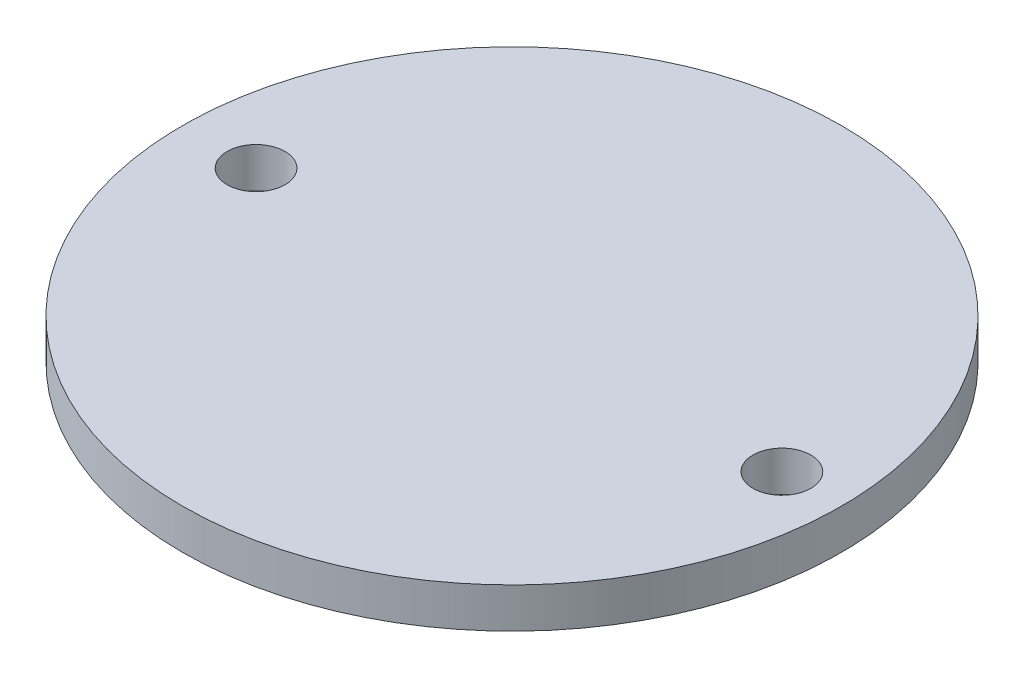
ISO-10303-21;
HEADER;
FILE_DESCRIPTION(('STEP AP214'),'2;1');
FILE_NAME('part.step','',(''),(''),'','','');
FILE_SCHEMA(('AUTOMOTIVE_DESIGN { 1 0 10303 214 1 1 1 1 }'));
ENDSEC;
DATA;
#1=APPLICATION_CONTEXT('core data for automotive mechanical design processes');
#2=APPLICATION_PROTOCOL_DEFINITION('international standard','automotive_design',2000,#1);
#3=PRODUCT_CONTEXT('',#1,'mechanical');
#4=PRODUCT('Part','Part','',(#3));
#5=PRODUCT_RELATED_PRODUCT_CATEGORY('part','',(#4));
#6=PRODUCT_DEFINITION_FORMATION('','',#4);
#7=PRODUCT_DEFINITION_CONTEXT('part definition',#1,'design');
#8=PRODUCT_DEFINITION('design','',#6,#7);
#9=PRODUCT_DEFINITION_SHAPE('','',#8);
#10=(LENGTH_UNIT() NAMED_UNIT(*) SI_UNIT(.MILLI.,.METRE.));
#11=(NAMED_UNIT(*) PLANE_ANGLE_UNIT() SI_UNIT($,.RADIAN.));
#12=(NAMED_UNIT(*) SI_UNIT($,.STERADIAN.) SOLID_ANGLE_UNIT());
#13=UNCERTAINTY_MEASURE_WITH_UNIT(LENGTH_MEASURE(1.E-05),#10,'distance_accuracy_value','');
#14=(GEOMETRIC_REPRESENTATION_CONTEXT(3) GLOBAL_UNCERTAINTY_ASSIGNED_CONTEXT((#13)) GLOBAL_UNIT_ASSIGNED_CONTEXT((#10,
#11,#12)) REPRESENTATION_CONTEXT('',''));
#15=CARTESIAN_POINT('',(0.,0.,0.));
#16=DIRECTION('',(0.,0.,1.));
#17=DIRECTION('',(1.,0.,0.));
#18=AXIS2_PLACEMENT_3D('',#15,#16,#17);
#19=CARTESIAN_POINT('',(0.,0.762,0.));
#20=DIRECTION('',(0.,-1.,0.));
#21=DIRECTION('',(0.,0.,-1.));
#22=AXIS2_PLACEMENT_3D('',#19,#20,#21);
#23=CYLINDRICAL_SURFACE('',#22,12.5349);
#24=CARTESIAN_POINT('',(0.,0.762,0.));
#25=DIRECTION('',(0.,1.,0.));
#26=DIRECTION('',(0.,0.,1.));
#27=AXIS2_PLACEMENT_3D('',#24,#25,#26);
#28=CIRCLE('',#27,12.5349);
#29=CARTESIAN_POINT('',(0.,0.762,12.5349));
#30=VERTEX_POINT('',#29);
#31=EDGE_CURVE('E10',#30,#30,#28,.T.);
#32=ORIENTED_EDGE('',*,*,#31,.F.);
#33=EDGE_LOOP('',(#32));
#34=FACE_BOUND('',#33,.T.);
#35=CARTESIAN_POINT('',(0.,-0.762,0.));
#36=DIRECTION('',(0.,1.,0.));
#37=DIRECTION('',(0.,0.,1.));
#38=AXIS2_PLACEMENT_3D('',#35,#36,#37);
#39=CIRCLE('',#38,12.5349);
#40=CARTESIAN_POINT('',(0.,-0.762,12.5349));
#41=VERTEX_POINT('',#40);
#42=EDGE_CURVE('E33',#41,#41,#39,.T.);
#43=ORIENTED_EDGE('',*,*,#42,.T.);
#44=EDGE_LOOP('',(#43));
#45=FACE_BOUND('',#44,.T.);
#46=ADVANCED_FACE('F30',(#34,#45),#23,.T.);
#47=CARTESIAN_POINT('',(0.,0.762,0.));
#48=DIRECTION('',(0.,1.,0.));
#49=DIRECTION('',(0.,0.,1.));
#50=AXIS2_PLACEMENT_3D('',#47,#48,#49);
#51=PLANE('',#50);
#52=CARTESIAN_POINT('',(10.265099988,0.762,0.));
#53=DIRECTION('',(0.,1.,0.));
#54=DIRECTION('',(0.,0.,1.));
#55=AXIS2_PLACEMENT_3D('',#52,#53,#54);
#56=CIRCLE('',#55,1.09999999999999);
#57=CARTESIAN_POINT('',(10.265099988,0.762,1.09999999999999));
#58=VERTEX_POINT('',#57);
#59=EDGE_CURVE('E48',#58,#58,#56,.T.);
#60=ORIENTED_EDGE('',*,*,#59,.F.);
#61=EDGE_LOOP('',(#60));
#62=FACE_BOUND('',#61,.T.);
#63=CARTESIAN_POINT('',(-9.734900012,0.762,0.));
#64=DIRECTION('',(0.,1.,0.));
#65=DIRECTION('',(0.,0.,1.));
#66=AXIS2_PLACEMENT_3D('',#63,#64,#65);
#67=CIRCLE('',#66,1.09999999999999);
#68=CARTESIAN_POINT('',(-9.734900012,0.762,1.09999999999999));
#69=VERTEX_POINT('',#68);
#70=EDGE_CURVE('E42',#69,#69,#67,.T.);
#71=ORIENTED_EDGE('',*,*,#70,.F.);
#72=EDGE_LOOP('',(#71));
#73=FACE_BOUND('',#72,.T.);
#74=ORIENTED_EDGE('',*,*,#31,.T.);
#75=EDGE_LOOP('',(#74));
#76=FACE_BOUND('',#75,.T.);
#77=ADVANCED_FACE('F64',(#62,#73,#76),#51,.T.);
#78=CARTESIAN_POINT('',(0.,-0.762,0.));
#79=DIRECTION('',(0.,1.,0.));
#80=DIRECTION('',(0.,0.,1.));
#81=AXIS2_PLACEMENT_3D('',#78,#79,#80);
#82=PLANE('',#81);
#83=CARTESIAN_POINT('',(10.265099988,-0.762,0.));
#84=DIRECTION('',(0.,1.,0.));
#85=DIRECTION('',(0.,0.,1.));
#86=AXIS2_PLACEMENT_3D('',#83,#84,#85);
#87=CIRCLE('',#86,1.09999999999999);
#88=CARTESIAN_POINT('',(10.265099988,-0.762,1.09999999999999));
#89=VERTEX_POINT('',#88);
#90=EDGE_CURVE('E45',#89,#89,#87,.T.);
#91=ORIENTED_EDGE('',*,*,#90,.T.);
#92=EDGE_LOOP('',(#91));
#93=FACE_BOUND('',#92,.T.);
#94=CARTESIAN_POINT('',(-9.734900012,-0.762,0.));
#95=DIRECTION('',(0.,1.,0.));
#96=DIRECTION('',(0.,0.,1.));
#97=AXIS2_PLACEMENT_3D('',#94,#95,#96);
#98=CIRCLE('',#97,1.09999999999999);
#99=CARTESIAN_POINT('',(-9.734900012,-0.762,1.09999999999999));
#100=VERTEX_POINT('',#99);
#101=EDGE_CURVE('E40',#100,#100,#98,.T.);
#102=ORIENTED_EDGE('',*,*,#101,.T.);
#103=EDGE_LOOP('',(#102));
#104=FACE_BOUND('',#103,.T.);
#105=ORIENTED_EDGE('',*,*,#42,.F.);
#106=EDGE_LOOP('',(#105));
#107=FACE_BOUND('',#106,.T.);
#108=ADVANCED_FACE('F54',(#93,#104,#107),#82,.F.);
#109=CARTESIAN_POINT('',(-9.734900012,-0.762,0.));
#110=DIRECTION('',(0.,1.,0.));
#111=DIRECTION('',(0.,0.,1.));
#112=AXIS2_PLACEMENT_3D('',#109,#110,#111);
#113=CYLINDRICAL_SURFACE('',#112,1.09999999999999);
#114=ORIENTED_EDGE('',*,*,#101,.F.);
#115=EDGE_LOOP('',(#114));
#116=FACE_BOUND('',#115,.T.);
#117=ORIENTED_EDGE('',*,*,#70,.T.);
#118=EDGE_LOOP('',(#117));
#119=FACE_BOUND('',#118,.T.);
#120=ADVANCED_FACE('F60',(#116,#119),#113,.F.);
#121=CARTESIAN_POINT('',(10.265099988,-0.762,0.));
#122=DIRECTION('',(0.,1.,0.));
#123=DIRECTION('',(0.,0.,1.));
#124=AXIS2_PLACEMENT_3D('',#121,#122,#123);
#125=CYLINDRICAL_SURFACE('',#124,1.09999999999999);
#126=ORIENTED_EDGE('',*,*,#90,.F.);
#127=EDGE_LOOP('',(#126));
#128=FACE_BOUND('',#127,.T.);
#129=ORIENTED_EDGE('',*,*,#59,.T.);
#130=EDGE_LOOP('',(#129));
#131=FACE_BOUND('',#130,.T.);
#132=ADVANCED_FACE('F57',(#128,#131),#125,.F.);
#133=CLOSED_SHELL('',(#46,#77,#108,#120,#132));
#134=MANIFOLD_SOLID_BREP('B2',#133);
#135=ADVANCED_BREP_SHAPE_REPRESENTATION('',(#18,#134),#14);
#136=SHAPE_DEFINITION_REPRESENTATION(#9,#135);
ENDSEC;
END-ISO-10303-21;
